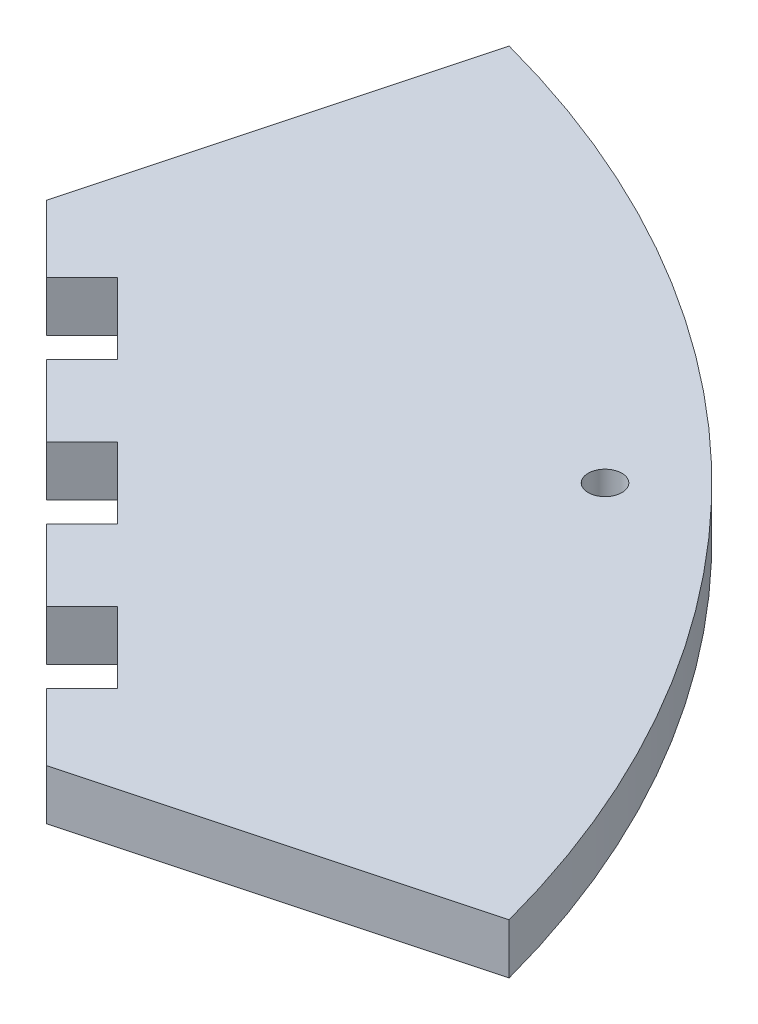
ISO-10303-21;
HEADER;
FILE_DESCRIPTION(('STEP AP214'),'2;1');
FILE_NAME('part.step','',(''),(''),'','','');
FILE_SCHEMA(('AUTOMOTIVE_DESIGN { 1 0 10303 214 1 1 1 1 }'));
ENDSEC;
DATA;
#1=APPLICATION_CONTEXT('core data for automotive mechanical design processes');
#2=APPLICATION_PROTOCOL_DEFINITION('international standard','automotive_design',2000,#1);
#3=PRODUCT_CONTEXT('',#1,'mechanical');
#4=PRODUCT('Part','Part','',(#3));
#5=PRODUCT_RELATED_PRODUCT_CATEGORY('part','',(#4));
#6=PRODUCT_DEFINITION_FORMATION('','',#4);
#7=PRODUCT_DEFINITION_CONTEXT('part definition',#1,'design');
#8=PRODUCT_DEFINITION('design','',#6,#7);
#9=PRODUCT_DEFINITION_SHAPE('','',#8);
#10=(LENGTH_UNIT() NAMED_UNIT(*) SI_UNIT(.MILLI.,.METRE.));
#11=(NAMED_UNIT(*) PLANE_ANGLE_UNIT() SI_UNIT($,.RADIAN.));
#12=(NAMED_UNIT(*) SI_UNIT($,.STERADIAN.) SOLID_ANGLE_UNIT());
#13=UNCERTAINTY_MEASURE_WITH_UNIT(LENGTH_MEASURE(1.E-05),#10,'distance_accuracy_value','');
#14=(GEOMETRIC_REPRESENTATION_CONTEXT(3) GLOBAL_UNCERTAINTY_ASSIGNED_CONTEXT((#13)) GLOBAL_UNIT_ASSIGNED_CONTEXT((#10,
#11,#12)) REPRESENTATION_CONTEXT('',''));
#15=CARTESIAN_POINT('',(0.,0.,0.));
#16=DIRECTION('',(0.,0.,1.));
#17=DIRECTION('',(1.,0.,0.));
#18=AXIS2_PLACEMENT_3D('',#15,#16,#17);
#19=CARTESIAN_POINT('',(42.7742146333513,5.07999999999999,-42.7742146333513));
#20=DIRECTION('',(0.707106781186548,0.,-0.707106781186548));
#21=DIRECTION('',(-0.707106781186548,0.,-0.707106781186548));
#22=AXIS2_PLACEMENT_3D('',#19,#20,#21);
#23=PLANE('',#22);
#24=DIRECTION('',(0.707106781186548,0.,0.707106781186548));
#25=VECTOR('',#24,1.);
#26=CARTESIAN_POINT('',(42.7742146333513,5.07999999999999,-42.7742146333513));
#27=LINE('',#26,#25);
#28=CARTESIAN_POINT('',(60.7347268754896,5.07999999999999,-24.813702391213));
#29=VERTEX_POINT('',#28);
#30=CARTESIAN_POINT('',(67.4699189662914,5.07999999999999,-18.0785103004112));
#31=VERTEX_POINT('',#30);
#32=EDGE_CURVE('E252',#29,#31,#27,.T.);
#33=ORIENTED_EDGE('',*,*,#32,.F.);
#34=DIRECTION('',(0.,1.,0.));
#35=VECTOR('',#34,1.);
#36=CARTESIAN_POINT('',(60.7347268754896,-0.001000000000001,-24.813702391213));
#37=LINE('',#36,#35);
#38=CARTESIAN_POINT('',(60.7347268754896,0.,-24.813702391213));
#39=VERTEX_POINT('',#38);
#40=EDGE_CURVE('E177',#39,#29,#37,.T.);
#41=ORIENTED_EDGE('',*,*,#40,.F.);
#42=DIRECTION('',(0.707106781186548,0.,0.707106781186548));
#43=VECTOR('',#42,1.);
#44=CARTESIAN_POINT('',(42.7742146333513,0.,-42.7742146333513));
#45=LINE('',#44,#43);
#46=CARTESIAN_POINT('',(67.4699189662914,0.,-18.0785103004113));
#47=VERTEX_POINT('',#46);
#48=EDGE_CURVE('E183',#39,#47,#45,.T.);
#49=ORIENTED_EDGE('',*,*,#48,.T.);
#50=DIRECTION('',(0.,-1.,0.));
#51=VECTOR('',#50,1.);
#52=CARTESIAN_POINT('',(67.4699189662914,5.07999999999999,-18.0785103004112));
#53=LINE('',#52,#51);
#54=EDGE_CURVE('E54',#31,#47,#53,.T.);
#55=ORIENTED_EDGE('',*,*,#54,.F.);
#56=EDGE_LOOP('',(#33,#41,#49,#55));
#57=FACE_BOUND('',#56,.T.);
#58=ADVANCED_FACE('F46',(#57),#23,.F.);
#59=CARTESIAN_POINT('',(46.366317081779,0.,-39.1821121849236));
#60=VERTEX_POINT('',#59);
#61=CARTESIAN_POINT('',(53.5505219786343,0.,-31.9979072880683));
#62=VERTEX_POINT('',#61);
#63=EDGE_CURVE('E325',#60,#62,#45,.T.);
#64=ORIENTED_EDGE('',*,*,#63,.T.);
#65=DIRECTION('',(0.,1.,0.));
#66=VECTOR('',#65,1.);
#67=CARTESIAN_POINT('',(53.5505219786343,-0.001000000000001,-31.9979072880683));
#68=LINE('',#67,#66);
#69=CARTESIAN_POINT('',(53.5505219786343,5.07999999999999,-31.9979072880683));
#70=VERTEX_POINT('',#69);
#71=EDGE_CURVE('E193',#62,#70,#68,.T.);
#72=ORIENTED_EDGE('',*,*,#71,.T.);
#73=CARTESIAN_POINT('',(46.366317081779,5.08000000000002,-39.1821121849236));
#74=VERTEX_POINT('',#73);
#75=EDGE_CURVE('E297',#74,#70,#27,.T.);
#76=ORIENTED_EDGE('',*,*,#75,.F.);
#77=DIRECTION('',(0.,1.,0.));
#78=VECTOR('',#77,1.);
#79=CARTESIAN_POINT('',(46.366317081779,-0.001000000000001,-39.1821121849236));
#80=LINE('',#79,#78);
#81=EDGE_CURVE('E210',#60,#74,#80,.T.);
#82=ORIENTED_EDGE('',*,*,#81,.F.);
#83=EDGE_LOOP('',(#64,#72,#76,#82));
#84=FACE_BOUND('',#83,.T.);
#85=ADVANCED_FACE('F324',(#84),#23,.F.);
#86=CARTESIAN_POINT('',(18.0785103004112,0.,-67.4699189662916));
#87=VERTEX_POINT('',#86);
#88=CARTESIAN_POINT('',(24.813702391213,0.,-60.7347268754896));
#89=VERTEX_POINT('',#88);
#90=EDGE_CURVE('E265',#87,#89,#45,.T.);
#91=ORIENTED_EDGE('',*,*,#90,.T.);
#92=DIRECTION('',(0.,1.,0.));
#93=VECTOR('',#92,1.);
#94=CARTESIAN_POINT('',(24.813702391213,-0.001000000000001,-60.7347268754896));
#95=LINE('',#94,#93);
#96=CARTESIAN_POINT('',(24.813702391213,5.07999999999999,-60.7347268754896));
#97=VERTEX_POINT('',#96);
#98=EDGE_CURVE('E235',#89,#97,#95,.T.);
#99=ORIENTED_EDGE('',*,*,#98,.T.);
#100=CARTESIAN_POINT('',(18.0785103004112,5.08000000000002,-67.4699189662916));
#101=VERTEX_POINT('',#100);
#102=EDGE_CURVE('E254',#101,#97,#27,.T.);
#103=ORIENTED_EDGE('',*,*,#102,.F.);
#104=DIRECTION('',(0.,-1.,0.));
#105=VECTOR('',#104,1.);
#106=CARTESIAN_POINT('',(18.0785103004112,5.08000000000002,-67.4699189662916));
#107=LINE('',#106,#105);
#108=EDGE_CURVE('E13',#101,#87,#107,.T.);
#109=ORIENTED_EDGE('',*,*,#108,.T.);
#110=EDGE_LOOP('',(#91,#99,#103,#109));
#111=FACE_BOUND('',#110,.T.);
#112=ADVANCED_FACE('F331',(#111),#23,.F.);
#113=CARTESIAN_POINT('',(0.,5.08000000000002,0.));
#114=DIRECTION('',(0.965925826289068,0.,0.258819045102523));
#115=DIRECTION('',(0.258819045102523,0.,-0.965925826289068));
#116=AXIS2_PLACEMENT_3D('',#113,#114,#115);
#117=PLANE('',#116);
#118=DIRECTION('',(-0.258819045102523,0.,0.965925826289068));
#119=VECTOR('',#118,1.);
#120=CARTESIAN_POINT('',(0.,0.,0.));
#121=LINE('',#120,#119);
#122=CARTESIAN_POINT('',(27.9395159188174,0.,-104.271692947905));
#123=VERTEX_POINT('',#122);
#124=EDGE_CURVE('E248',#123,#87,#121,.T.);
#125=ORIENTED_EDGE('',*,*,#124,.T.);
#126=ORIENTED_EDGE('',*,*,#108,.F.);
#127=DIRECTION('',(-0.258819045102523,0.,0.965925826289068));
#128=VECTOR('',#127,1.);
#129=CARTESIAN_POINT('',(0.,5.08000000000002,0.));
#130=LINE('',#129,#128);
#131=CARTESIAN_POINT('',(27.9395159188174,5.07999999999999,-104.271692947905));
#132=VERTEX_POINT('',#131);
#133=EDGE_CURVE('E249',#132,#101,#130,.T.);
#134=ORIENTED_EDGE('',*,*,#133,.F.);
#135=DIRECTION('',(0.,-1.,0.));
#136=VECTOR('',#135,1.);
#137=CARTESIAN_POINT('',(27.9395159188174,5.07999999999999,-104.271692947905));
#138=LINE('',#137,#136);
#139=EDGE_CURVE('E262',#132,#123,#138,.T.);
#140=ORIENTED_EDGE('',*,*,#139,.T.);
#141=EDGE_LOOP('',(#125,#126,#134,#140));
#142=FACE_BOUND('',#141,.T.);
#143=ADVANCED_FACE('F48',(#142),#117,.F.);
#144=CARTESIAN_POINT('',(31.9979072880683,0.,-53.5505219786343));
#145=VERTEX_POINT('',#144);
#146=CARTESIAN_POINT('',(39.1821121849235,0.,-46.366317081779));
#147=VERTEX_POINT('',#146);
#148=EDGE_CURVE('E269',#145,#147,#45,.T.);
#149=ORIENTED_EDGE('',*,*,#148,.T.);
#150=DIRECTION('',(0.,1.,0.));
#151=VECTOR('',#150,1.);
#152=CARTESIAN_POINT('',(39.1821121849235,-0.001000000000001,-46.366317081779));
#153=LINE('',#152,#151);
#154=CARTESIAN_POINT('',(39.1821121849235,5.07999999999999,-46.366317081779));
#155=VERTEX_POINT('',#154);
#156=EDGE_CURVE('E212',#147,#155,#153,.T.);
#157=ORIENTED_EDGE('',*,*,#156,.T.);
#158=CARTESIAN_POINT('',(31.9979072880683,5.07999999999999,-53.5505219786343));
#159=VERTEX_POINT('',#158);
#160=EDGE_CURVE('E258',#159,#155,#27,.T.);
#161=ORIENTED_EDGE('',*,*,#160,.F.);
#162=DIRECTION('',(0.,1.,0.));
#163=VECTOR('',#162,1.);
#164=CARTESIAN_POINT('',(31.9979072880683,-0.00100000000006345,-53.5505219786343));
#165=LINE('',#164,#163);
#166=EDGE_CURVE('E239',#145,#159,#165,.T.);
#167=ORIENTED_EDGE('',*,*,#166,.F.);
#168=EDGE_LOOP('',(#149,#157,#161,#167));
#169=FACE_BOUND('',#168,.T.);
#170=ADVANCED_FACE('F311',(#169),#23,.F.);
#171=CARTESIAN_POINT('',(0.,5.08000000000002,0.));
#172=DIRECTION('',(-0.258819045102523,0.,-0.965925826289068));
#173=DIRECTION('',(-0.965925826289068,0.,0.258819045102523));
#174=AXIS2_PLACEMENT_3D('',#171,#172,#173);
#175=PLANE('',#174);
#176=DIRECTION('',(0.965925826289068,0.,-0.258819045102523));
#177=VECTOR('',#176,1.);
#178=CARTESIAN_POINT('',(0.,0.,0.));
#179=LINE('',#178,#177);
#180=CARTESIAN_POINT('',(104.271692947905,0.,-27.9395159188174));
#181=VERTEX_POINT('',#180);
#182=EDGE_CURVE('E268',#47,#181,#179,.T.);
#183=ORIENTED_EDGE('',*,*,#182,.T.);
#184=DIRECTION('',(0.,-1.,0.));
#185=VECTOR('',#184,1.);
#186=CARTESIAN_POINT('',(104.271692947905,5.08000000000002,-27.9395159188174));
#187=LINE('',#186,#185);
#188=CARTESIAN_POINT('',(104.271692947905,5.08000000000002,-27.9395159188174));
#189=VERTEX_POINT('',#188);
#190=EDGE_CURVE('E274',#189,#181,#187,.T.);
#191=ORIENTED_EDGE('',*,*,#190,.F.);
#192=DIRECTION('',(0.965925826289068,0.,-0.258819045102523));
#193=VECTOR('',#192,1.);
#194=CARTESIAN_POINT('',(0.,5.08000000000002,0.));
#195=LINE('',#194,#193);
#196=EDGE_CURVE('E257',#31,#189,#195,.T.);
#197=ORIENTED_EDGE('',*,*,#196,.F.);
#198=ORIENTED_EDGE('',*,*,#54,.T.);
#199=EDGE_LOOP('',(#183,#191,#197,#198));
#200=FACE_BOUND('',#199,.T.);
#201=ADVANCED_FACE('F280',(#200),#175,.F.);
#202=CARTESIAN_POINT('',(0.,5.08000000000002,0.));
#203=DIRECTION('',(0.,-1.,0.));
#204=DIRECTION('',(0.,0.,-1.));
#205=AXIS2_PLACEMENT_3D('',#202,#203,#204);
#206=CYLINDRICAL_SURFACE('',#205,107.95);
#207=CARTESIAN_POINT('',(0.,0.,0.));
#208=DIRECTION('',(0.,1.,0.));
#209=DIRECTION('',(0.,0.,1.));
#210=AXIS2_PLACEMENT_3D('',#207,#208,#209);
#211=CIRCLE('',#210,107.95);
#212=EDGE_CURVE('E253',#181,#123,#211,.T.);
#213=ORIENTED_EDGE('',*,*,#212,.T.);
#214=ORIENTED_EDGE('',*,*,#139,.F.);
#215=CARTESIAN_POINT('',(0.,5.08000000000002,0.));
#216=DIRECTION('',(0.,1.,0.));
#217=DIRECTION('',(0.,0.,1.));
#218=AXIS2_PLACEMENT_3D('',#215,#216,#217);
#219=CIRCLE('',#218,107.95);
#220=EDGE_CURVE('E260',#189,#132,#219,.T.);
#221=ORIENTED_EDGE('',*,*,#220,.F.);
#222=ORIENTED_EDGE('',*,*,#190,.T.);
#223=EDGE_LOOP('',(#213,#214,#221,#222));
#224=FACE_BOUND('',#223,.T.);
#225=ADVANCED_FACE('F288',(#224),#206,.T.);
#226=CARTESIAN_POINT('',(0.,5.08000000000002,0.));
#227=DIRECTION('',(0.,1.,0.));
#228=DIRECTION('',(0.,0.,1.));
#229=AXIS2_PLACEMENT_3D('',#226,#227,#228);
#230=PLANE('',#229);
#231=DIRECTION('',(0.707106781186548,0.,-0.707106781186547));
#232=VECTOR('',#231,1.);
#233=CARTESIAN_POINT('',(60.7347268754896,5.07999999999999,-24.813702391213));
#234=LINE('',#233,#232);
#235=CARTESIAN_POINT('',(64.3268293239173,5.07999999999999,-28.4058048396407));
#236=VERTEX_POINT('',#235);
#237=EDGE_CURVE('E165',#29,#236,#234,.T.);
#238=ORIENTED_EDGE('',*,*,#237,.F.);
#239=ORIENTED_EDGE('',*,*,#32,.T.);
#240=ORIENTED_EDGE('',*,*,#196,.T.);
#241=ORIENTED_EDGE('',*,*,#220,.T.);
#242=ORIENTED_EDGE('',*,*,#133,.T.);
#243=ORIENTED_EDGE('',*,*,#102,.T.);
#244=DIRECTION('',(-0.707106781186548,0.,0.707106781186548));
#245=VECTOR('',#244,1.);
#246=CARTESIAN_POINT('',(28.4058048396407,5.07999999999999,-64.3268293239173));
#247=LINE('',#246,#245);
#248=CARTESIAN_POINT('',(28.4058048396407,5.07999999999999,-64.3268293239173));
#249=VERTEX_POINT('',#248);
#250=EDGE_CURVE('E227',#249,#97,#247,.T.);
#251=ORIENTED_EDGE('',*,*,#250,.F.);
#252=DIRECTION('',(-0.707106781186547,0.,-0.707106781186548));
#253=VECTOR('',#252,1.);
#254=CARTESIAN_POINT('',(35.590009736496,5.07999999999999,-57.1426244270619));
#255=LINE('',#254,#253);
#256=CARTESIAN_POINT('',(35.590009736496,5.07999999999999,-57.1426244270619));
#257=VERTEX_POINT('',#256);
#258=EDGE_CURVE('E232',#257,#249,#255,.T.);
#259=ORIENTED_EDGE('',*,*,#258,.F.);
#260=DIRECTION('',(0.707106781186548,0.,-0.707106781186548));
#261=VECTOR('',#260,1.);
#262=CARTESIAN_POINT('',(31.9979072880683,5.07999999999999,-53.5505219786343));
#263=LINE('',#262,#261);
#264=EDGE_CURVE('E229',#159,#257,#263,.T.);
#265=ORIENTED_EDGE('',*,*,#264,.F.);
#266=ORIENTED_EDGE('',*,*,#160,.T.);
#267=DIRECTION('',(-0.707106781186548,0.,0.707106781186547));
#268=VECTOR('',#267,1.);
#269=CARTESIAN_POINT('',(42.7742146333513,5.07999999999999,-49.9584195302066));
#270=LINE('',#269,#268);
#271=CARTESIAN_POINT('',(42.7742146333513,5.07999999999999,-49.9584195302066));
#272=VERTEX_POINT('',#271);
#273=EDGE_CURVE('E207',#272,#155,#270,.T.);
#274=ORIENTED_EDGE('',*,*,#273,.F.);
#275=DIRECTION('',(-0.707106781186548,0.,-0.707106781186548));
#276=VECTOR('',#275,1.);
#277=CARTESIAN_POINT('',(49.9584195302066,5.07999999999999,-42.7742146333513));
#278=LINE('',#277,#276);
#279=CARTESIAN_POINT('',(49.9584195302066,5.07999999999999,-42.7742146333513));
#280=VERTEX_POINT('',#279);
#281=EDGE_CURVE('E204',#280,#272,#278,.T.);
#282=ORIENTED_EDGE('',*,*,#281,.F.);
#283=DIRECTION('',(0.707106781186548,0.,-0.707106781186547));
#284=VECTOR('',#283,1.);
#285=CARTESIAN_POINT('',(46.366317081779,5.08000000000002,-39.1821121849236));
#286=LINE('',#285,#284);
#287=EDGE_CURVE('E201',#74,#280,#286,.T.);
#288=ORIENTED_EDGE('',*,*,#287,.F.);
#289=ORIENTED_EDGE('',*,*,#75,.T.);
#290=DIRECTION('',(-0.707106781186549,0.,0.707106781186546));
#291=VECTOR('',#290,1.);
#292=CARTESIAN_POINT('',(57.1426244270619,5.07999999999999,-35.590009736496));
#293=LINE('',#292,#291);
#294=CARTESIAN_POINT('',(57.1426244270619,5.07999999999999,-35.590009736496));
#295=VERTEX_POINT('',#294);
#296=EDGE_CURVE('E170',#295,#70,#293,.T.);
#297=ORIENTED_EDGE('',*,*,#296,.F.);
#298=DIRECTION('',(-0.707106781186548,0.,-0.707106781186548));
#299=VECTOR('',#298,1.);
#300=CARTESIAN_POINT('',(64.3268293239173,5.07999999999999,-28.4058048396407));
#301=LINE('',#300,#299);
#302=EDGE_CURVE('E185',#236,#295,#301,.T.);
#303=ORIENTED_EDGE('',*,*,#302,.F.);
#304=EDGE_LOOP('',(#238,#239,#240,#241,#242,#243,#251,#259,#265,#266,#274,#282,#288,#289,#297,#303));
#305=FACE_BOUND('',#304,.T.);
#306=CARTESIAN_POINT('',(70.9440233564463,5.07999999999999,-70.9440233564465));
#307=DIRECTION('',(0.,1.,0.));
#308=DIRECTION('',(0.,0.,1.));
#309=AXIS2_PLACEMENT_3D('',#306,#307,#308);
#310=CIRCLE('',#309,1.69999999999999);
#311=CARTESIAN_POINT('',(70.9440233564463,5.07999999999999,-69.2440233564465));
#312=VERTEX_POINT('',#311);
#313=EDGE_CURVE('E176',#312,#312,#310,.T.);
#314=ORIENTED_EDGE('',*,*,#313,.F.);
#315=EDGE_LOOP('',(#314));
#316=FACE_BOUND('',#315,.T.);
#317=ADVANCED_FACE('F294',(#305,#316),#230,.T.);
#318=CARTESIAN_POINT('',(0.,0.,0.));
#319=DIRECTION('',(0.,1.,0.));
#320=DIRECTION('',(0.,0.,1.));
#321=AXIS2_PLACEMENT_3D('',#318,#319,#320);
#322=PLANE('',#321);
#323=ORIENTED_EDGE('',*,*,#48,.F.);
#324=DIRECTION('',(-0.707106781186548,0.,0.707106781186547));
#325=VECTOR('',#324,1.);
#326=CARTESIAN_POINT('',(60.7347268754896,0.,-24.813702391213));
#327=LINE('',#326,#325);
#328=CARTESIAN_POINT('',(64.3268293239173,0.,-28.4058048396406));
#329=VERTEX_POINT('',#328);
#330=EDGE_CURVE('E162',#329,#39,#327,.T.);
#331=ORIENTED_EDGE('',*,*,#330,.F.);
#332=DIRECTION('',(0.707106781186548,0.,0.707106781186548));
#333=VECTOR('',#332,1.);
#334=CARTESIAN_POINT('',(64.3268293239173,0.,-28.4058048396406));
#335=LINE('',#334,#333);
#336=CARTESIAN_POINT('',(57.1426244270619,0.,-35.590009736496));
#337=VERTEX_POINT('',#336);
#338=EDGE_CURVE('E173',#337,#329,#335,.T.);
#339=ORIENTED_EDGE('',*,*,#338,.F.);
#340=DIRECTION('',(0.707106781186549,0.,-0.707106781186546));
#341=VECTOR('',#340,1.);
#342=CARTESIAN_POINT('',(57.1426244270619,0.,-35.590009736496));
#343=LINE('',#342,#341);
#344=EDGE_CURVE('E61',#62,#337,#343,.T.);
#345=ORIENTED_EDGE('',*,*,#344,.F.);
#346=ORIENTED_EDGE('',*,*,#63,.F.);
#347=DIRECTION('',(-0.707106781186548,0.,0.707106781186547));
#348=VECTOR('',#347,1.);
#349=CARTESIAN_POINT('',(46.366317081779,0.,-39.1821121849236));
#350=LINE('',#349,#348);
#351=CARTESIAN_POINT('',(49.9584195302066,0.,-42.7742146333513));
#352=VERTEX_POINT('',#351);
#353=EDGE_CURVE('E198',#352,#60,#350,.T.);
#354=ORIENTED_EDGE('',*,*,#353,.F.);
#355=DIRECTION('',(0.707106781186548,0.,0.707106781186548));
#356=VECTOR('',#355,1.);
#357=CARTESIAN_POINT('',(49.9584195302066,0.,-42.7742146333513));
#358=LINE('',#357,#356);
#359=CARTESIAN_POINT('',(42.7742146333513,0.,-49.9584195302066));
#360=VERTEX_POINT('',#359);
#361=EDGE_CURVE('E187',#360,#352,#358,.T.);
#362=ORIENTED_EDGE('',*,*,#361,.F.);
#363=DIRECTION('',(0.707106781186548,0.,-0.707106781186547));
#364=VECTOR('',#363,1.);
#365=CARTESIAN_POINT('',(42.7742146333513,0.,-49.9584195302066));
#366=LINE('',#365,#364);
#367=EDGE_CURVE('E69',#147,#360,#366,.T.);
#368=ORIENTED_EDGE('',*,*,#367,.F.);
#369=ORIENTED_EDGE('',*,*,#148,.F.);
#370=DIRECTION('',(-0.707106781186548,0.,0.707106781186548));
#371=VECTOR('',#370,1.);
#372=CARTESIAN_POINT('',(31.9979072880683,0.,-53.5505219786343));
#373=LINE('',#372,#371);
#374=CARTESIAN_POINT('',(35.590009736496,0.,-57.1426244270619));
#375=VERTEX_POINT('',#374);
#376=EDGE_CURVE('E220',#375,#145,#373,.T.);
#377=ORIENTED_EDGE('',*,*,#376,.F.);
#378=DIRECTION('',(0.707106781186547,0.,0.707106781186548));
#379=VECTOR('',#378,1.);
#380=CARTESIAN_POINT('',(35.590009736496,0.,-57.1426244270619));
#381=LINE('',#380,#379);
#382=CARTESIAN_POINT('',(28.4058048396407,0.,-64.3268293239173));
#383=VERTEX_POINT('',#382);
#384=EDGE_CURVE('E222',#383,#375,#381,.T.);
#385=ORIENTED_EDGE('',*,*,#384,.F.);
#386=DIRECTION('',(0.707106781186548,0.,-0.707106781186548));
#387=VECTOR('',#386,1.);
#388=CARTESIAN_POINT('',(28.4058048396407,0.,-64.3268293239173));
#389=LINE('',#388,#387);
#390=EDGE_CURVE('E224',#89,#383,#389,.T.);
#391=ORIENTED_EDGE('',*,*,#390,.F.);
#392=ORIENTED_EDGE('',*,*,#90,.F.);
#393=ORIENTED_EDGE('',*,*,#124,.F.);
#394=ORIENTED_EDGE('',*,*,#212,.F.);
#395=ORIENTED_EDGE('',*,*,#182,.F.);
#396=EDGE_LOOP('',(#323,#331,#339,#345,#346,#354,#362,#368,#369,#377,#385,#391,#392,#393,#394,#395));
#397=FACE_BOUND('',#396,.T.);
#398=CARTESIAN_POINT('',(70.9440233564463,0.,-70.9440233564465));
#399=DIRECTION('',(0.,1.,0.));
#400=DIRECTION('',(0.,0.,1.));
#401=AXIS2_PLACEMENT_3D('',#398,#399,#400);
#402=CIRCLE('',#401,1.69999999999999);
#403=CARTESIAN_POINT('',(70.9440233564463,0.,-69.2440233564465));
#404=VERTEX_POINT('',#403);
#405=EDGE_CURVE('E245',#404,#404,#402,.T.);
#406=ORIENTED_EDGE('',*,*,#405,.T.);
#407=EDGE_LOOP('',(#406));
#408=FACE_BOUND('',#407,.T.);
#409=ADVANCED_FACE('F180',(#397,#408),#322,.F.);
#410=CARTESIAN_POINT('',(70.9440233564463,5.07999999999999,-70.9440233564465));
#411=DIRECTION('',(0.,1.,0.));
#412=DIRECTION('',(0.,0.,1.));
#413=AXIS2_PLACEMENT_3D('',#410,#411,#412);
#414=CYLINDRICAL_SURFACE('',#413,1.69999999999999);
#415=ORIENTED_EDGE('',*,*,#313,.T.);
#416=EDGE_LOOP('',(#415));
#417=FACE_BOUND('',#416,.T.);
#418=ORIENTED_EDGE('',*,*,#405,.F.);
#419=EDGE_LOOP('',(#418));
#420=FACE_BOUND('',#419,.T.);
#421=ADVANCED_FACE('F363',(#417,#420),#414,.F.);
#422=CARTESIAN_POINT('',(28.4058048396407,-0.001000000000001,-64.3268293239173));
#423=DIRECTION('',(-0.707106781186547,0.,-0.707106781186547));
#424=DIRECTION('',(-0.707106781186548,0.,0.707106781186548));
#425=AXIS2_PLACEMENT_3D('',#422,#423,#424);
#426=PLANE('',#425);
#427=ORIENTED_EDGE('',*,*,#390,.T.);
#428=DIRECTION('',(0.,1.,0.));
#429=VECTOR('',#428,1.);
#430=CARTESIAN_POINT('',(28.4058048396407,-0.001000000000001,-64.3268293239173));
#431=LINE('',#430,#429);
#432=EDGE_CURVE('E199',#383,#249,#431,.T.);
#433=ORIENTED_EDGE('',*,*,#432,.T.);
#434=ORIENTED_EDGE('',*,*,#250,.T.);
#435=ORIENTED_EDGE('',*,*,#98,.F.);
#436=EDGE_LOOP('',(#427,#433,#434,#435));
#437=FACE_BOUND('',#436,.T.);
#438=ADVANCED_FACE('F345',(#437),#426,.F.);
#439=CARTESIAN_POINT('',(35.590009736496,-0.00100000000006345,-57.1426244270619));
#440=DIRECTION('',(0.707106781186548,0.,-0.707106781186547));
#441=DIRECTION('',(-0.707106781186547,0.,-0.707106781186548));
#442=AXIS2_PLACEMENT_3D('',#439,#440,#441);
#443=PLANE('',#442);
#444=ORIENTED_EDGE('',*,*,#384,.T.);
#445=DIRECTION('',(0.,1.,0.));
#446=VECTOR('',#445,1.);
#447=CARTESIAN_POINT('',(35.590009736496,-0.00100000000006345,-57.1426244270619));
#448=LINE('',#447,#446);
#449=EDGE_CURVE('E237',#375,#257,#448,.T.);
#450=ORIENTED_EDGE('',*,*,#449,.T.);
#451=ORIENTED_EDGE('',*,*,#258,.T.);
#452=ORIENTED_EDGE('',*,*,#432,.F.);
#453=EDGE_LOOP('',(#444,#450,#451,#452));
#454=FACE_BOUND('',#453,.T.);
#455=ADVANCED_FACE('F347',(#454),#443,.F.);
#456=CARTESIAN_POINT('',(31.9979072880683,-0.00100000000006345,-53.5505219786343));
#457=DIRECTION('',(0.707106781186547,0.,0.707106781186547));
#458=DIRECTION('',(0.707106781186548,0.,-0.707106781186548));
#459=AXIS2_PLACEMENT_3D('',#456,#457,#458);
#460=PLANE('',#459);
#461=ORIENTED_EDGE('',*,*,#376,.T.);
#462=ORIENTED_EDGE('',*,*,#166,.T.);
#463=ORIENTED_EDGE('',*,*,#264,.T.);
#464=ORIENTED_EDGE('',*,*,#449,.F.);
#465=EDGE_LOOP('',(#461,#462,#463,#464));
#466=FACE_BOUND('',#465,.T.);
#467=ADVANCED_FACE('F350',(#466),#460,.F.);
#468=CARTESIAN_POINT('',(46.366317081779,-0.001000000000001,-39.1821121849236));
#469=DIRECTION('',(0.707106781186547,0.,0.707106781186548));
#470=DIRECTION('',(0.707106781186548,0.,-0.707106781186547));
#471=AXIS2_PLACEMENT_3D('',#468,#469,#470);
#472=PLANE('',#471);
#473=ORIENTED_EDGE('',*,*,#353,.T.);
#474=ORIENTED_EDGE('',*,*,#81,.T.);
#475=ORIENTED_EDGE('',*,*,#287,.T.);
#476=DIRECTION('',(0.,1.,0.));
#477=VECTOR('',#476,1.);
#478=CARTESIAN_POINT('',(49.9584195302066,-0.001000000000001,-42.7742146333513));
#479=LINE('',#478,#477);
#480=EDGE_CURVE('E209',#352,#280,#479,.T.);
#481=ORIENTED_EDGE('',*,*,#480,.F.);
#482=EDGE_LOOP('',(#473,#474,#475,#481));
#483=FACE_BOUND('',#482,.T.);
#484=ADVANCED_FACE('F352',(#483),#472,.F.);
#485=CARTESIAN_POINT('',(42.7742146333513,-0.001000000000001,-49.9584195302066));
#486=DIRECTION('',(-0.707106781186547,0.,-0.707106781186548));
#487=DIRECTION('',(-0.707106781186548,0.,0.707106781186547));
#488=AXIS2_PLACEMENT_3D('',#485,#486,#487);
#489=PLANE('',#488);
#490=ORIENTED_EDGE('',*,*,#367,.T.);
#491=DIRECTION('',(0.,1.,0.));
#492=VECTOR('',#491,1.);
#493=CARTESIAN_POINT('',(42.7742146333513,-0.001000000000001,-49.9584195302066));
#494=LINE('',#493,#492);
#495=EDGE_CURVE('E215',#360,#272,#494,.T.);
#496=ORIENTED_EDGE('',*,*,#495,.T.);
#497=ORIENTED_EDGE('',*,*,#273,.T.);
#498=ORIENTED_EDGE('',*,*,#156,.F.);
#499=EDGE_LOOP('',(#490,#496,#497,#498));
#500=FACE_BOUND('',#499,.T.);
#501=ADVANCED_FACE('F313',(#500),#489,.F.);
#502=CARTESIAN_POINT('',(49.9584195302066,-0.001000000000001,-42.7742146333513));
#503=DIRECTION('',(0.707106781186547,0.,-0.707106781186547));
#504=DIRECTION('',(-0.707106781186548,0.,-0.707106781186548));
#505=AXIS2_PLACEMENT_3D('',#502,#503,#504);
#506=PLANE('',#505);
#507=ORIENTED_EDGE('',*,*,#361,.T.);
#508=ORIENTED_EDGE('',*,*,#480,.T.);
#509=ORIENTED_EDGE('',*,*,#281,.T.);
#510=ORIENTED_EDGE('',*,*,#495,.F.);
#511=EDGE_LOOP('',(#507,#508,#509,#510));
#512=FACE_BOUND('',#511,.T.);
#513=ADVANCED_FACE('F319',(#512),#506,.F.);
#514=CARTESIAN_POINT('',(60.7347268754896,-0.001000000000001,-24.813702391213));
#515=DIRECTION('',(0.707106781186547,0.,0.707106781186548));
#516=DIRECTION('',(0.707106781186548,0.,-0.707106781186547));
#517=AXIS2_PLACEMENT_3D('',#514,#515,#516);
#518=PLANE('',#517);
#519=ORIENTED_EDGE('',*,*,#330,.T.);
#520=ORIENTED_EDGE('',*,*,#40,.T.);
#521=ORIENTED_EDGE('',*,*,#237,.T.);
#522=DIRECTION('',(0.,1.,0.));
#523=VECTOR('',#522,1.);
#524=CARTESIAN_POINT('',(64.3268293239173,-0.00099999999993855,-28.4058048396406));
#525=LINE('',#524,#523);
#526=EDGE_CURVE('E158',#329,#236,#525,.T.);
#527=ORIENTED_EDGE('',*,*,#526,.F.);
#528=EDGE_LOOP('',(#519,#520,#521,#527));
#529=FACE_BOUND('',#528,.T.);
#530=ADVANCED_FACE('F160',(#529),#518,.F.);
#531=CARTESIAN_POINT('',(57.1426244270619,-0.001000000000001,-35.590009736496));
#532=DIRECTION('',(-0.707106781186546,0.,-0.707106781186549));
#533=DIRECTION('',(-0.707106781186549,0.,0.707106781186546));
#534=AXIS2_PLACEMENT_3D('',#531,#532,#533);
#535=PLANE('',#534);
#536=ORIENTED_EDGE('',*,*,#344,.T.);
#537=DIRECTION('',(0.,1.,0.));
#538=VECTOR('',#537,1.);
#539=CARTESIAN_POINT('',(57.1426244270619,-0.001000000000001,-35.590009736496));
#540=LINE('',#539,#538);
#541=EDGE_CURVE('E169',#337,#295,#540,.T.);
#542=ORIENTED_EDGE('',*,*,#541,.T.);
#543=ORIENTED_EDGE('',*,*,#296,.T.);
#544=ORIENTED_EDGE('',*,*,#71,.F.);
#545=EDGE_LOOP('',(#536,#542,#543,#544));
#546=FACE_BOUND('',#545,.T.);
#547=ADVANCED_FACE('F326',(#546),#535,.F.);
#548=CARTESIAN_POINT('',(64.3268293239173,-0.00099999999993855,-28.4058048396406));
#549=DIRECTION('',(0.707106781186547,0.,-0.707106781186547));
#550=DIRECTION('',(-0.707106781186548,0.,-0.707106781186548));
#551=AXIS2_PLACEMENT_3D('',#548,#549,#550);
#552=PLANE('',#551);
#553=ORIENTED_EDGE('',*,*,#338,.T.);
#554=ORIENTED_EDGE('',*,*,#526,.T.);
#555=ORIENTED_EDGE('',*,*,#302,.T.);
#556=ORIENTED_EDGE('',*,*,#541,.F.);
#557=EDGE_LOOP('',(#553,#554,#555,#556));
#558=FACE_BOUND('',#557,.T.);
#559=ADVANCED_FACE('F174',(#558),#552,.F.);
#560=CLOSED_SHELL('',(#58,#85,#112,#143,#170,#201,#225,#317,#409,#421,#438,#455,#467,#484,#501,
#513,#530,#547,#559));
#561=MANIFOLD_SOLID_BREP('B2',#560);
#562=ADVANCED_BREP_SHAPE_REPRESENTATION('',(#18,#561),#14);
#563=SHAPE_DEFINITION_REPRESENTATION(#9,#562);
ENDSEC;
END-ISO-10303-21;
